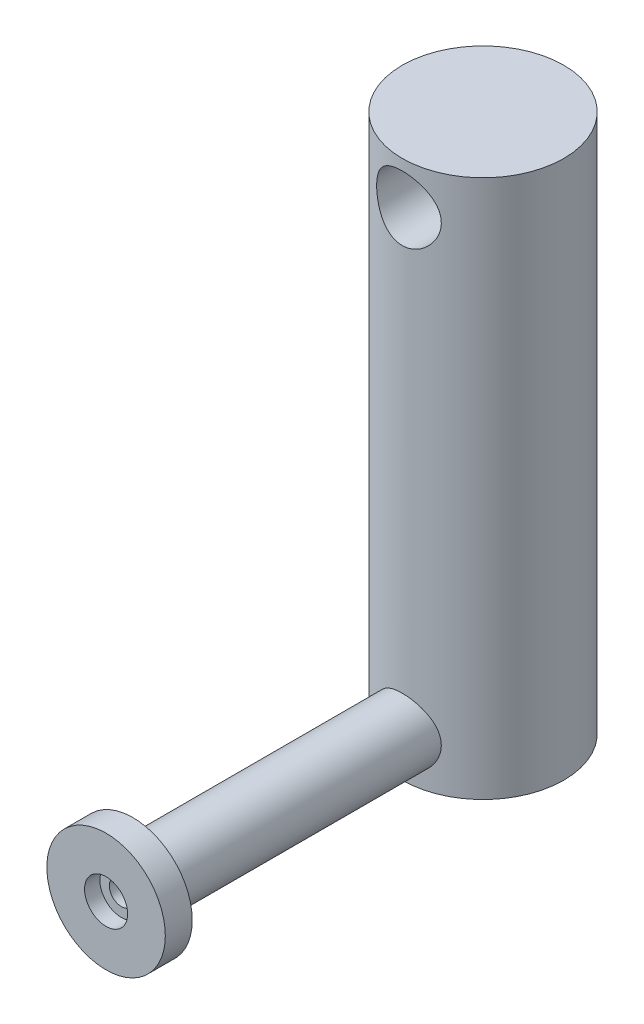
ISO-10303-21;
HEADER;
FILE_DESCRIPTION(('STEP AP214'),'2;1');
FILE_NAME('part.step','',(''),(''),'','','');
FILE_SCHEMA(('AUTOMOTIVE_DESIGN { 1 0 10303 214 1 1 1 1 }'));
ENDSEC;
DATA;
#1=APPLICATION_CONTEXT('core data for automotive mechanical design processes');
#2=APPLICATION_PROTOCOL_DEFINITION('international standard','automotive_design',2000,#1);
#3=PRODUCT_CONTEXT('',#1,'mechanical');
#4=PRODUCT('Part','Part','',(#3));
#5=PRODUCT_RELATED_PRODUCT_CATEGORY('part','',(#4));
#6=PRODUCT_DEFINITION_FORMATION('','',#4);
#7=PRODUCT_DEFINITION_CONTEXT('part definition',#1,'design');
#8=PRODUCT_DEFINITION('design','',#6,#7);
#9=PRODUCT_DEFINITION_SHAPE('','',#8);
#10=(LENGTH_UNIT() NAMED_UNIT(*) SI_UNIT(.MILLI.,.METRE.));
#11=(NAMED_UNIT(*) PLANE_ANGLE_UNIT() SI_UNIT($,.RADIAN.));
#12=(NAMED_UNIT(*) SI_UNIT($,.STERADIAN.) SOLID_ANGLE_UNIT());
#13=UNCERTAINTY_MEASURE_WITH_UNIT(LENGTH_MEASURE(1.E-05),#10,'distance_accuracy_value','');
#14=(GEOMETRIC_REPRESENTATION_CONTEXT(3) GLOBAL_UNCERTAINTY_ASSIGNED_CONTEXT((#13)) GLOBAL_UNIT_ASSIGNED_CONTEXT((#10,
#11,#12)) REPRESENTATION_CONTEXT('',''));
#15=CARTESIAN_POINT('',(0.,0.,0.));
#16=DIRECTION('',(0.,0.,1.));
#17=DIRECTION('',(1.,0.,0.));
#18=AXIS2_PLACEMENT_3D('',#15,#16,#17);
#19=CARTESIAN_POINT('',(0.,8.,65.));
#20=DIRECTION('',(0.,0.,-1.));
#21=DIRECTION('',(-1.,0.,0.));
#22=AXIS2_PLACEMENT_3D('',#19,#20,#21);
#23=CYLINDRICAL_SURFACE('',#22,6.);
#24=CARTESIAN_POINT('',(0.,8.,65.));
#25=DIRECTION('',(0.,0.,1.));
#26=DIRECTION('',(1.,0.,0.));
#27=AXIS2_PLACEMENT_3D('',#24,#25,#26);
#28=CIRCLE('',#27,6.);
#29=CARTESIAN_POINT('',(6.,8.,65.));
#30=VERTEX_POINT('',#29);
#31=EDGE_CURVE('E11',#30,#30,#28,.T.);
#32=ORIENTED_EDGE('',*,*,#31,.F.);
#33=EDGE_LOOP('',(#32));
#34=FACE_BOUND('',#33,.T.);
#35=CARTESIAN_POINT('',(6.,8.,13.7477270848675));
#36=CARTESIAN_POINT('',(5.99999875640954,8.16076598482738,13.7477283260629));
#37=CARTESIAN_POINT('',(5.99352975206176,8.32158110601548,13.7505565594333));
#38=CARTESIAN_POINT('',(5.96771672897827,8.64204882535129,13.7617785399654));
#39=CARTESIAN_POINT('',(5.94836482999676,8.80170065146873,13.7701756935283));
#40=CARTESIAN_POINT('',(5.89694174030869,9.11890142617686,13.7922754357519));
#41=CARTESIAN_POINT('',(5.86484520413903,9.27644553381237,13.8059885951419));
#42=CARTESIAN_POINT('',(5.78825391878448,9.58804060527395,13.8382744776157));
#43=CARTESIAN_POINT('',(5.74375401859824,9.74209008901072,13.8568492194736));
#44=CARTESIAN_POINT('',(5.64299599700453,10.0449832651282,13.8981849934125));
#45=CARTESIAN_POINT('',(5.58678827846126,10.1938461795796,13.9209280318917));
#46=CARTESIAN_POINT('',(5.46298123967255,10.4861745059142,13.969977180975));
#47=CARTESIAN_POINT('',(5.39537758446074,10.6296378383192,13.9962846467221));
#48=CARTESIAN_POINT('',(5.17633416323045,11.0504811630918,14.0794173286744));
#49=CARTESIAN_POINT('',(5.00853494267613,11.3186931077142,14.1405074748907));
#50=CARTESIAN_POINT('',(4.62391158998239,11.8378592545825,14.2710405221571));
#51=CARTESIAN_POINT('',(4.40499626343136,12.0871970513873,14.340752300891));
#52=CARTESIAN_POINT('',(4.0481020989243,12.4317390645763,14.4439708651047));
#53=CARTESIAN_POINT('',(3.9242905158216,12.5417399755175,14.4781748598032));
#54=CARTESIAN_POINT('',(3.66779743847793,12.7512789373329,14.5452673983772));
#55=CARTESIAN_POINT('',(3.53511902618019,12.850820593021,14.5781563930343));
#56=CARTESIAN_POINT('',(3.25615691069843,13.042541605752,14.6430448615306));
#57=CARTESIAN_POINT('',(3.10954147620186,13.1342681993675,14.6749563607157));
#58=CARTESIAN_POINT('',(2.80847871906791,13.3049385222444,14.7355355933009));
#59=CARTESIAN_POINT('',(2.65403441109174,13.3838871235516,14.7642045617649));
#60=CARTESIAN_POINT('',(2.33831705380735,13.5283274480482,14.8174861755334));
#61=CARTESIAN_POINT('',(2.1770447537532,13.5938206431435,14.8420992644581));
#62=CARTESIAN_POINT('',(1.8488303602226,13.710706307039,14.8865456688032));
#63=CARTESIAN_POINT('',(1.68188862975967,13.762099676745,14.9063792895972));
#64=CARTESIAN_POINT('',(1.35182764993867,13.8480957076311,14.9398371015626));
#65=CARTESIAN_POINT('',(1.18891435676812,13.8833905448022,14.9537153305611));
#66=CARTESIAN_POINT('',(0.860364736698411,13.940333707631,14.9762104160573));
#67=CARTESIAN_POINT('',(0.694728571347243,13.9619828399113,14.9848275835451));
#68=CARTESIAN_POINT('',(0.362083680846927,13.9913910715253,14.9965524359366));
#69=CARTESIAN_POINT('',(0.195075387211746,13.9991543815219,14.9996617909972));
#70=CARTESIAN_POINT('',(-0.139014166426379,14.0007146652515,15.0002858279534));
#71=CARTESIAN_POINT('',(-0.306095423657633,13.9945121299872,14.9978007065363));
#72=CARTESIAN_POINT('',(-0.629581360842826,13.9689571486784,14.9876056811723));
#73=CARTESIAN_POINT('',(-0.786056489987585,13.950366478925,14.9801985155737));
#74=CARTESIAN_POINT('',(-1.09682374164985,13.9009947102182,14.9606558816458));
#75=CARTESIAN_POINT('',(-1.25111513504043,13.8702096346988,14.9485188709466));
#76=CARTESIAN_POINT('',(-1.55636446880933,13.7967547638698,14.9198265516691));
#77=CARTESIAN_POINT('',(-1.70732347781249,13.7540888400518,14.9032726824411));
#78=CARTESIAN_POINT('',(-2.00504692560526,13.6572347463826,14.8661462906548));
#79=CARTESIAN_POINT('',(-2.15180974700395,13.6030421998243,14.8455722418593));
#80=CARTESIAN_POINT('',(-2.44232275401438,13.4827122452092,14.8005733913406));
#81=CARTESIAN_POINT('',(-2.58599723661979,13.4164113777625,14.7760965609745));
#82=CARTESIAN_POINT('',(-2.86725918170996,13.2729288476492,14.7241067343258));
#83=CARTESIAN_POINT('',(-3.00484439132129,13.1957432013856,14.696592627269));
#84=CARTESIAN_POINT('',(-3.40726603321778,12.948688374456,14.6104618941818));
#85=CARTESIAN_POINT('',(-3.66195901653258,12.7632418772394,14.5482260457696));
#86=CARTESIAN_POINT('',(-4.15437949370373,12.3419915764659,14.4156330049764));
#87=CARTESIAN_POINT('',(-4.38989525780836,12.1036809528053,14.3450108782861));
#88=CARTESIAN_POINT('',(-4.71121812404964,11.7191971043517,14.2413889925105));
#89=CARTESIAN_POINT('',(-4.81305918105095,11.5864329939912,14.2072110490304));
#90=CARTESIAN_POINT('',(-5.0054684951315,11.3125897118592,14.1405668936191));
#91=CARTESIAN_POINT('',(-5.09604089492643,11.171513624108,14.1081000551767));
#92=CARTESIAN_POINT('',(-5.2677144885335,10.8776679791937,14.0449207716186));
#93=CARTESIAN_POINT('',(-5.34846830074845,10.7246787891823,14.0142856556237));
#94=CARTESIAN_POINT('',(-5.49666677344656,10.4117640686962,13.9568252487564));
#95=CARTESIAN_POINT('',(-5.56411683616809,10.2518413860096,13.9299984127055));
#96=CARTESIAN_POINT('',(-5.68507549818268,9.92615715736025,13.8810726170423));
#97=CARTESIAN_POINT('',(-5.73858849912392,9.76039747367877,13.8589721651234));
#98=CARTESIAN_POINT('',(-5.83111405710326,9.42425050711976,13.8202977451039));
#99=CARTESIAN_POINT('',(-5.87012778144672,9.2538635979558,13.803723332125));
#100=CARTESIAN_POINT('',(-5.93126188446899,8.92037550293277,13.7775602957139));
#101=CARTESIAN_POINT('',(-5.95426866502425,8.75746509869363,13.7676067715781));
#102=CARTESIAN_POINT('',(-5.98682783069773,8.43005941910831,13.7534799529363));
#103=CARTESIAN_POINT('',(-5.99638101339171,8.26556423829532,13.7493063157788));
#104=CARTESIAN_POINT('',(-6.00192022727181,7.93634499724553,13.7468891908443));
#105=CARTESIAN_POINT('',(-5.99790972463035,7.77162100623468,13.7486441880165));
#106=CARTESIAN_POINT('',(-5.97637695694085,7.44323030234847,13.7580178863429));
#107=CARTESIAN_POINT('',(-5.95885503253298,7.27956356292335,13.7656364396694));
#108=CARTESIAN_POINT('',(-5.91189113707813,6.96388493285904,13.7858678469555));
#109=CARTESIAN_POINT('',(-5.88318889041452,6.81174216524755,13.7981698606254));
#110=CARTESIAN_POINT('',(-5.81422990546568,6.51049878730527,13.8273689308218));
#111=CARTESIAN_POINT('',(-5.77396942701893,6.3613991784739,13.8442674746596));
#112=CARTESIAN_POINT('',(-5.68227161206331,6.06725076083849,13.8821556875076));
#113=CARTESIAN_POINT('',(-5.63083646021821,5.92220116649752,13.9031445567712));
#114=CARTESIAN_POINT('',(-5.51718647350251,5.63689974950036,13.9486342853423));
#115=CARTESIAN_POINT('',(-5.45496750289055,5.49664979237216,13.9731364914375));
#116=CARTESIAN_POINT('',(-5.31751145640008,5.21622103433918,14.0260368054118));
#117=CARTESIAN_POINT('',(-5.24185178482307,5.07627148339986,14.054551887834));
#118=CARTESIAN_POINT('',(-5.07988717682862,4.80313174732677,14.1139004091642));
#119=CARTESIAN_POINT('',(-4.99357859530799,4.66994389885387,14.144734640495));
#120=CARTESIAN_POINT('',(-4.81086355761932,4.41103058661941,14.2079180408565));
#121=CARTESIAN_POINT('',(-4.71445526541627,4.28530648622994,14.2402674847459));
#122=CARTESIAN_POINT('',(-4.51210358125893,4.04197483985671,14.3056711379351));
#123=CARTESIAN_POINT('',(-4.40615981558121,3.92436761231666,14.338725374819));
#124=CARTESIAN_POINT('',(-4.17710486838273,3.68947089789745,14.4071898083664));
#125=CARTESIAN_POINT('',(-4.05330323673504,3.57285146369597,14.442592979753));
#126=CARTESIAN_POINT('',(-3.79611595891185,3.35044107746035,14.5123136561683));
#127=CARTESIAN_POINT('',(-3.66273336488668,3.24464670276108,14.5466315019691));
#128=CARTESIAN_POINT('',(-3.38706145939603,3.04451435610422,14.6132792135403));
#129=CARTESIAN_POINT('',(-3.24476806677012,2.95018169264924,14.6456081547515));
#130=CARTESIAN_POINT('',(-2.95225256674959,2.77378136334621,14.7073633349577));
#131=CARTESIAN_POINT('',(-2.80203390506011,2.69170842578633,14.7367908197248));
#132=CARTESIAN_POINT('',(-2.49453307495679,2.54045157600446,14.7919473555791));
#133=CARTESIAN_POINT('',(-2.3372490996887,2.47127098437562,14.8176754534518));
#134=CARTESIAN_POINT('',(-2.01680521759424,2.34650155372972,14.8646797598965));
#135=CARTESIAN_POINT('',(-1.85364780662784,2.29090701787589,14.8859578338886));
#136=CARTESIAN_POINT('',(-1.52264805192432,2.19385845199867,14.9234471639802));
#137=CARTESIAN_POINT('',(-1.35480680859647,2.15240113036746,14.9396595994531));
#138=CARTESIAN_POINT('',(-1.01574606559106,2.08407562736267,14.9665350610502));
#139=CARTESIAN_POINT('',(-0.844526795116486,2.05720645967028,14.9771984623478));
#140=CARTESIAN_POINT('',(-0.511396994408886,2.01963967541453,14.9921458117432));
#141=CARTESIAN_POINT('',(-0.349608608417646,2.00800071584866,14.9968008342727));
#142=CARTESIAN_POINT('',(-0.0255568035504899,1.99786526314398,15.0008532559057));
#143=CARTESIAN_POINT('',(0.13670659774313,1.99936828956347,15.0002508472092));
#144=CARTESIAN_POINT('',(0.46044915787151,2.01549904517884,14.9938053140504));
#145=CARTESIAN_POINT('',(0.621928426150299,2.03012488656084,14.9879629433954));
#146=CARTESIAN_POINT('',(0.942913616351044,2.07234304237388,14.9711970812456));
#147=CARTESIAN_POINT('',(1.10241954563225,2.09993530843377,14.9602736087057));
#148=CARTESIAN_POINT('',(1.41340092731344,2.16675006249559,14.9340514560138));
#149=CARTESIAN_POINT('',(1.56497209153591,2.20558587323356,14.9188987624389));
#150=CARTESIAN_POINT('',(1.8642394853253,2.29482683138478,14.8844652752771));
#151=CARTESIAN_POINT('',(2.01193442094207,2.34523578871987,14.8651831223981));
#152=CARTESIAN_POINT('',(2.302462712288,2.45717619515102,14.8229622791787));
#153=CARTESIAN_POINT('',(2.44529715629449,2.51870513472081,14.8000244139869));
#154=CARTESIAN_POINT('',(2.72537941223682,2.65243971671062,14.7510179336099));
#155=CARTESIAN_POINT('',(2.86262507421093,2.72464941936831,14.7249481285447));
#156=CARTESIAN_POINT('',(3.13662388518831,2.88260994638361,14.6690826919464));
#157=CARTESIAN_POINT('',(3.27309180108705,2.96881555131694,14.6391738407242));
#158=CARTESIAN_POINT('',(3.53838180351729,3.15171951689201,14.5773253906917));
#159=CARTESIAN_POINT('',(3.66720122604104,3.24842150069046,14.5453850922484));
#160=CARTESIAN_POINT('',(3.91649343612946,3.45170886191089,14.480251425724));
#161=CARTESIAN_POINT('',(4.03696455988818,3.55829619963078,14.447057809883));
#162=CARTESIAN_POINT('',(4.26890539529755,3.78072670262354,14.3802300314779));
#163=CARTESIAN_POINT('',(4.38037483126384,3.89657015115671,14.3465958554578));
#164=CARTESIAN_POINT('',(4.6003520349242,4.14436931770692,14.2776350231095));
#165=CARTESIAN_POINT('',(4.7082445488358,4.27687901691599,14.2423331872708));
#166=CARTESIAN_POINT('',(4.91246454048886,4.55081614977952,14.1731899755842));
#167=CARTESIAN_POINT('',(5.0087959135827,4.69224055512316,14.1393481102969));
#168=CARTESIAN_POINT('',(5.18930521843519,4.98330426589871,14.0741014017048));
#169=CARTESIAN_POINT('',(5.27347593316246,5.13294837739946,14.0426980106418));
#170=CARTESIAN_POINT('',(5.42888140715686,5.43938662075409,13.9833532160291));
#171=CARTESIAN_POINT('',(5.50012246229139,5.59617722596415,13.9554101296628));
#172=CARTESIAN_POINT('',(5.62329338728312,5.90161698772481,13.9062060888812));
#173=CARTESIAN_POINT('',(5.67638059374281,6.0497399517391,13.8845710059473));
#174=CARTESIAN_POINT('',(5.77085722264898,6.3501563851321,13.8455704717994));
#175=CARTESIAN_POINT('',(5.81225194839873,6.50244792929539,13.8282030853728));
#176=CARTESIAN_POINT('',(5.88290316620707,6.80992357107783,13.7982941020335));
#177=CARTESIAN_POINT('',(5.91218652902551,6.9651004584769,13.7857418266595));
#178=CARTESIAN_POINT('',(5.95843701087143,7.27754448449443,13.7658152395796));
#179=CARTESIAN_POINT('',(5.97541127868373,7.43481035575321,13.7584379224814));
#180=CARTESIAN_POINT('',(5.99076318011059,7.66032523302881,13.751755327731));
#181=CARTESIAN_POINT('',(5.99422579943118,7.72819955445766,13.7502459479373));
#182=CARTESIAN_POINT('',(5.99884455686221,7.86404631736154,13.7482315272618));
#183=CARTESIAN_POINT('',(6.00000052586257,7.9320187656651,13.7477265600177));
#184=CARTESIAN_POINT('',(6.,8.,13.7477270848675));
#185=B_SPLINE_CURVE_WITH_KNOTS('',3,(#35,#36,#37,#38,#39,#40,#41,#42,#43,#44,#45,#46,#47,#48,
#49,#50,#51,#52,#53,#54,#55,#56,#57,#58,#59,#60,#61,#62,#63,#64,#65,#66,#67,#68,#69,#70,#71,#72,
#73,#74,#75,#76,#77,#78,#79,#80,#81,#82,#83,#84,#85,#86,#87,#88,#89,#90,#91,#92,#93,#94,#95,#96,
#97,#98,#99,#100,#101,#102,#103,#104,#105,#106,#107,#108,#109,#110,#111,#112,#113,#114,#115,
#116,#117,#118,#119,#120,#121,#122,#123,#124,#125,#126,#127,#128,#129,#130,#131,#132,#133,#134,
#135,#136,#137,#138,#139,#140,#141,#142,#143,#144,#145,#146,#147,#148,#149,#150,#151,#152,#153,
#154,#155,#156,#157,#158,#159,#160,#161,#162,#163,#164,#165,#166,#167,#168,#169,#170,#171,#172,
#173,#174,#175,#176,#177,#178,#179,#180,#181,#182,#183,#184),.UNSPECIFIED.,.T.,.F.,(4,2,2,2,2,2,
2,2,2,2,2,2,2,2,2,2,2,2,2,2,2,2,2,2,2,2,2,2,2,2,2,2,2,2,2,2,2,2,2,2,2,2,2,2,2,2,2,2,2,2,2,2,2,2,
2,2,2,2,2,2,2,2,2,2,2,2,2,2,2,2,2,2,2,2,4),(0.,0.482229125007608,0.964753492666788,
1.44824230932755,1.93193221431692,2.41358131868909,2.89541405552194,3.85788445035762,
4.87027013417452,5.37714851669966,5.88385162504574,6.41078994114098,6.93752686828076,
7.4642061442031,7.99085176020979,8.4920122856123,8.99314318371741,9.49412209577398,
9.99508339499092,10.4677763229104,10.9406235219094,11.4133168189293,11.8861899210207,
12.3659950936627,12.8459763227003,13.8053197638543,14.827648638094,15.3395121452938,
15.8511869156833,16.3775800271824,16.9037589447639,17.429771480738,17.9557416594036,
18.4495809207953,18.9433909044569,19.4370747055101,19.9307460605728,20.3961592499499,
20.8617232138062,21.3271962410503,21.7928481801528,22.2772086524077,22.7617353827804,
23.2463503490362,23.7309843170643,24.2515501140932,24.7719508068031,25.2925916122044,
25.8130078923152,26.3335580277819,26.8538895128004,27.3740997647064,27.8942748403263,
28.3804860466243,28.8666794781986,29.3528029784681,29.8389246652723,30.309990273523,
30.7812111812125,31.2523258775871,31.7236201282936,32.2155707501999,32.7076917276986,
33.1999105039097,33.6921443490278,34.2149887213889,34.7376564316676,35.2606330684224,
35.7833543637692,36.2593204433439,36.7350702933027,37.2097588887462,37.684171576794,
37.8880712265046,38.0919858243933),.UNSPECIFIED.);
#186=CARTESIAN_POINT('',(6.,8.,13.7477270848675));
#187=VERTEX_POINT('',#186);
#188=EDGE_CURVE('E51',#187,#187,#185,.T.);
#189=ORIENTED_EDGE('',*,*,#188,.T.);
#190=EDGE_LOOP('',(#189));
#191=FACE_BOUND('',#190,.T.);
#192=ADVANCED_FACE('F45',(#34,#191),#23,.T.);
#193=CARTESIAN_POINT('',(0.,100.,0.));
#194=DIRECTION('',(0.,-1.,0.));
#195=DIRECTION('',(0.,0.,-1.));
#196=AXIS2_PLACEMENT_3D('',#193,#194,#195);
#197=CYLINDRICAL_SURFACE('',#196,15.);
#198=ORIENTED_EDGE('',*,*,#188,.F.);
#199=EDGE_LOOP('',(#198));
#200=FACE_BOUND('',#199,.T.);
#201=ADVANCED_FACE('F67',(#200),#197,.F.);
#202=CARTESIAN_POINT('',(0.,8.,70.));
#203=DIRECTION('',(0.,0.,-1.));
#204=DIRECTION('',(-1.,0.,0.));
#205=AXIS2_PLACEMENT_3D('',#202,#203,#204);
#206=CYLINDRICAL_SURFACE('',#205,11.);
#207=CARTESIAN_POINT('',(0.,8.,70.));
#208=DIRECTION('',(0.,0.,1.));
#209=DIRECTION('',(1.,0.,0.));
#210=AXIS2_PLACEMENT_3D('',#207,#208,#209);
#211=CIRCLE('',#210,11.);
#212=CARTESIAN_POINT('',(11.,8.,70.));
#213=VERTEX_POINT('',#212);
#214=EDGE_CURVE('E55',#213,#213,#211,.T.);
#215=ORIENTED_EDGE('',*,*,#214,.F.);
#216=EDGE_LOOP('',(#215));
#217=FACE_BOUND('',#216,.T.);
#218=CARTESIAN_POINT('',(0.,8.,65.));
#219=DIRECTION('',(0.,0.,1.));
#220=DIRECTION('',(1.,0.,0.));
#221=AXIS2_PLACEMENT_3D('',#218,#219,#220);
#222=CIRCLE('',#221,11.);
#223=CARTESIAN_POINT('',(11.,8.,65.));
#224=VERTEX_POINT('',#223);
#225=EDGE_CURVE('E59',#224,#224,#222,.T.);
#226=ORIENTED_EDGE('',*,*,#225,.T.);
#227=EDGE_LOOP('',(#226));
#228=FACE_BOUND('',#227,.T.);
#229=ADVANCED_FACE('F71',(#217,#228),#206,.T.);
#230=CARTESIAN_POINT('',(0.,8.,70.));
#231=DIRECTION('',(0.,0.,1.));
#232=DIRECTION('',(1.,0.,0.));
#233=AXIS2_PLACEMENT_3D('',#230,#231,#232);
#234=PLANE('',#233);
#235=CARTESIAN_POINT('',(0.,8.,70.));
#236=DIRECTION('',(0.,0.,1.));
#237=DIRECTION('',(1.,0.,0.));
#238=AXIS2_PLACEMENT_3D('',#235,#236,#237);
#239=CIRCLE('',#238,4.);
#240=CARTESIAN_POINT('',(4.,8.,70.));
#241=VERTEX_POINT('',#240);
#242=EDGE_CURVE('E160',#241,#241,#239,.T.);
#243=ORIENTED_EDGE('',*,*,#242,.F.);
#244=EDGE_LOOP('',(#243));
#245=FACE_BOUND('',#244,.T.);
#246=ORIENTED_EDGE('',*,*,#214,.T.);
#247=EDGE_LOOP('',(#246));
#248=FACE_BOUND('',#247,.T.);
#249=ADVANCED_FACE('F75',(#245,#248),#234,.T.);
#250=CARTESIAN_POINT('',(0.,8.,65.));
#251=DIRECTION('',(0.,0.,1.));
#252=DIRECTION('',(1.,0.,0.));
#253=AXIS2_PLACEMENT_3D('',#250,#251,#252);
#254=PLANE('',#253);
#255=ORIENTED_EDGE('',*,*,#31,.T.);
#256=EDGE_LOOP('',(#255));
#257=FACE_BOUND('',#256,.T.);
#258=ORIENTED_EDGE('',*,*,#225,.F.);
#259=EDGE_LOOP('',(#258));
#260=FACE_BOUND('',#259,.T.);
#261=ADVANCED_FACE('F77',(#257,#260),#254,.F.);
#262=CARTESIAN_POINT('',(0.,8.,67.15));
#263=DIRECTION('',(0.,0.,1.));
#264=DIRECTION('',(1.,0.,0.));
#265=AXIS2_PLACEMENT_3D('',#262,#263,#264);
#266=CYLINDRICAL_SURFACE('',#265,4.);
#267=CARTESIAN_POINT('',(0.,8.,67.15));
#268=DIRECTION('',(0.,0.,1.));
#269=DIRECTION('',(1.,0.,0.));
#270=AXIS2_PLACEMENT_3D('',#267,#268,#269);
#271=CIRCLE('',#270,4.);
#272=CARTESIAN_POINT('',(4.,8.,67.15));
#273=VERTEX_POINT('',#272);
#274=EDGE_CURVE('E164',#273,#273,#271,.T.);
#275=ORIENTED_EDGE('',*,*,#274,.F.);
#276=EDGE_LOOP('',(#275));
#277=FACE_BOUND('',#276,.T.);
#278=ORIENTED_EDGE('',*,*,#242,.T.);
#279=EDGE_LOOP('',(#278));
#280=FACE_BOUND('',#279,.T.);
#281=ADVANCED_FACE('F80',(#277,#280),#266,.F.);
#282=CARTESIAN_POINT('',(0.,8.,67.15));
#283=DIRECTION('',(0.,0.,1.));
#284=DIRECTION('',(1.,0.,0.));
#285=AXIS2_PLACEMENT_3D('',#282,#283,#284);
#286=PLANE('',#285);
#287=CARTESIAN_POINT('',(0.,8.,67.15));
#288=DIRECTION('',(0.,0.,1.));
#289=DIRECTION('',(1.,0.,0.));
#290=AXIS2_PLACEMENT_3D('',#287,#288,#289);
#291=CIRCLE('',#290,2.25);
#292=CARTESIAN_POINT('',(2.25,8.,67.15));
#293=VERTEX_POINT('',#292);
#294=EDGE_CURVE('E161',#293,#293,#291,.T.);
#295=ORIENTED_EDGE('',*,*,#294,.F.);
#296=EDGE_LOOP('',(#295));
#297=FACE_BOUND('',#296,.T.);
#298=ORIENTED_EDGE('',*,*,#274,.T.);
#299=EDGE_LOOP('',(#298));
#300=FACE_BOUND('',#299,.T.);
#301=ADVANCED_FACE('F86',(#297,#300),#286,.T.);
#302=CARTESIAN_POINT('',(0.,8.,64.65));
#303=DIRECTION('',(0.,0.,1.));
#304=DIRECTION('',(1.,0.,0.));
#305=AXIS2_PLACEMENT_3D('',#302,#303,#304);
#306=CYLINDRICAL_SURFACE('',#305,2.25);
#307=CARTESIAN_POINT('',(0.,8.,64.65));
#308=DIRECTION('',(0.,0.,1.));
#309=DIRECTION('',(1.,0.,0.));
#310=AXIS2_PLACEMENT_3D('',#307,#308,#309);
#311=CIRCLE('',#310,2.25);
#312=CARTESIAN_POINT('',(2.25,8.,64.65));
#313=VERTEX_POINT('',#312);
#314=EDGE_CURVE('E159',#313,#313,#311,.T.);
#315=ORIENTED_EDGE('',*,*,#314,.F.);
#316=EDGE_LOOP('',(#315));
#317=FACE_BOUND('',#316,.T.);
#318=ORIENTED_EDGE('',*,*,#294,.T.);
#319=EDGE_LOOP('',(#318));
#320=FACE_BOUND('',#319,.T.);
#321=ADVANCED_FACE('F90',(#317,#320),#306,.F.);
#322=CARTESIAN_POINT('',(0.,8.,64.65));
#323=DIRECTION('',(0.,0.,1.));
#324=DIRECTION('',(1.,0.,0.));
#325=AXIS2_PLACEMENT_3D('',#322,#323,#324);
#326=PLANE('',#325);
#327=ORIENTED_EDGE('',*,*,#314,.T.);
#328=EDGE_LOOP('',(#327));
#329=FACE_BOUND('',#328,.T.);
#330=ADVANCED_FACE('F94',(#329),#326,.T.);
#331=CLOSED_SHELL('',(#192,#201,#229,#249,#261,#281,#301,#321,#330));
#332=MANIFOLD_SOLID_BREP('B2',#331);
#333=CARTESIAN_POINT('',(0.,100.,0.));
#334=DIRECTION('',(0.,-1.,0.));
#335=DIRECTION('',(0.,0.,-1.));
#336=AXIS2_PLACEMENT_3D('',#333,#334,#335);
#337=CYLINDRICAL_SURFACE('',#336,15.);
#338=CARTESIAN_POINT('',(0.,100.,0.));
#339=DIRECTION('',(0.,1.,0.));
#340=DIRECTION('',(0.,0.,1.));
#341=AXIS2_PLACEMENT_3D('',#338,#339,#340);
#342=CIRCLE('',#341,15.);
#343=CARTESIAN_POINT('',(0.,100.,15.));
#344=VERTEX_POINT('',#343);
#345=EDGE_CURVE('E196',#344,#344,#342,.T.);
#346=ORIENTED_EDGE('',*,*,#345,.F.);
#347=EDGE_LOOP('',(#346));
#348=FACE_BOUND('',#347,.T.);
#349=CARTESIAN_POINT('',(0.,0.,0.));
#350=DIRECTION('',(0.,1.,0.));
#351=DIRECTION('',(0.,0.,1.));
#352=AXIS2_PLACEMENT_3D('',#349,#350,#351);
#353=CIRCLE('',#352,15.);
#354=CARTESIAN_POINT('',(0.,0.,15.));
#355=VERTEX_POINT('',#354);
#356=EDGE_CURVE('E200',#355,#355,#353,.T.);
#357=ORIENTED_EDGE('',*,*,#356,.T.);
#358=EDGE_LOOP('',(#357));
#359=FACE_BOUND('',#358,.T.);
#360=CARTESIAN_POINT('',(0.,98.,-15.));
#361=CARTESIAN_POINT('',(0.161313644504795,97.9999990763371,-14.9999992799423));
#362=CARTESIAN_POINT('',(0.322689516963507,97.9934855013958,-14.9973905442872));
#363=CARTESIAN_POINT('',(0.64429962319549,97.9674898782125,-14.9870209396163));
#364=CARTESIAN_POINT('',(0.80453302218813,97.9479991684452,-14.9792566295469));
#365=CARTESIAN_POINT('',(1.12295032515216,97.8961896196803,-14.9587594719095));
#366=CARTESIAN_POINT('',(1.28112908028619,97.863843282184,-14.9460159747332));
#367=CARTESIAN_POINT('',(1.5940111010847,97.7866317701457,-14.9158923525357));
#368=CARTESIAN_POINT('',(1.74871291854088,97.741761479865,-14.8985103329152));
#369=CARTESIAN_POINT('',(2.05297112205075,97.6401188046392,-14.85963474988));
#370=CARTESIAN_POINT('',(2.20254446893524,97.5833911959363,-14.8381566801894));
#371=CARTESIAN_POINT('',(2.49626491179011,97.4584017024408,-14.7915782226374));
#372=CARTESIAN_POINT('',(2.64040995626987,97.3901355093753,-14.7664764822838));
#373=CARTESIAN_POINT('',(2.92227692731373,97.2426681971428,-14.7132880124765));
#374=CARTESIAN_POINT('',(3.06000372368526,97.1634755552049,-14.6852036009652));
#375=CARTESIAN_POINT('',(3.32842124549353,96.9946751836688,-14.6267056927006));
#376=CARTESIAN_POINT('',(3.45910939916273,96.9050636845176,-14.5962913543435));
#377=CARTESIAN_POINT('',(3.8503463050522,96.6134009680257,-14.4999578839521));
#378=CARTESIAN_POINT('',(4.09812078052022,96.3947515037883,-14.4312855983673));
#379=CARTESIAN_POINT('',(4.55459108369287,95.9197284822013,-14.2938006085538));
#380=CARTESIAN_POINT('',(4.76326779263535,95.6633365776994,-14.2249878521747));
#381=CARTESIAN_POINT('',(5.04723766459798,95.2488756985875,-14.1257237119283));
#382=CARTESIAN_POINT('',(5.13866506559553,95.1022648970436,-14.0926348838902));
#383=CARTESIAN_POINT('',(5.30875946518038,94.8012358186711,-14.0294439987206));
#384=CARTESIAN_POINT('',(5.38743171147838,94.6468207871239,-13.9993407152693));
#385=CARTESIAN_POINT('',(5.53135072514938,94.3311496933485,-13.9431035259271));
#386=CARTESIAN_POINT('',(5.59659658448499,94.1698931693136,-13.9169698885377));
#387=CARTESIAN_POINT('',(5.71298893930062,93.8417492993048,-13.8695965651366));
#388=CARTESIAN_POINT('',(5.76414249748569,93.6748648211636,-13.8483544285077));
#389=CARTESIAN_POINT('',(5.84985002952935,93.3442805788518,-13.812361071961));
#390=CARTESIAN_POINT('',(5.88504634552834,93.1807744062204,-13.7973611781672));
#391=CARTESIAN_POINT('',(5.94169028877153,92.8510475821048,-13.7730632035884));
#392=CARTESIAN_POINT('',(5.96314412514811,92.6848281913697,-13.763762547854));
#393=CARTESIAN_POINT('',(5.99206783200916,92.3509840794924,-13.7511953307051));
#394=CARTESIAN_POINT('',(5.99954065663821,92.1833596627484,-13.7479274945764));
#395=CARTESIAN_POINT('',(6.00041818162586,91.8480709001244,-13.7475446397));
#396=CARTESIAN_POINT('',(5.99382353813072,91.6804065564714,-13.7504293339811));
#397=CARTESIAN_POINT('',(5.96760177471961,91.3581150722591,-13.7618280557533));
#398=CARTESIAN_POINT('',(5.94891756277296,91.2033956295018,-13.7699346208222));
#399=CARTESIAN_POINT('',(5.8996396544996,90.896159193445,-13.7911192754836));
#400=CARTESIAN_POINT('',(5.86904203850858,90.7436429421696,-13.8041990012772));
#401=CARTESIAN_POINT('',(5.79624600676145,90.4419202009817,-13.8349228158605));
#402=CARTESIAN_POINT('',(5.75405038400525,90.2927129235482,-13.8525658056772));
#403=CARTESIAN_POINT('',(5.65841794933909,89.9984373160379,-13.8919033105674));
#404=CARTESIAN_POINT('',(5.60497681726874,89.8533706010244,-13.9135993823432));
#405=CARTESIAN_POINT('',(5.48612076549079,89.5654107880334,-13.9608971317125));
#406=CARTESIAN_POINT('',(5.42048769239742,89.4226192329473,-13.9865682596972));
#407=CARTESIAN_POINT('',(5.27846344073438,89.1430045696326,-14.0407834641431));
#408=CARTESIAN_POINT('',(5.20206861926845,89.0061835030654,-14.0693285125008));
#409=CARTESIAN_POINT('',(5.03904071569065,88.7392438024992,-14.1285380661927));
#410=CARTESIAN_POINT('',(4.95240626250742,88.6091260694235,-14.1592028551284));
#411=CARTESIAN_POINT('',(4.76942720642661,88.3562485672333,-14.2218815851021));
#412=CARTESIAN_POINT('',(4.67308210238212,88.2334891783898,-14.2538955957211));
#413=CARTESIAN_POINT('',(4.46337699329053,87.9867125608195,-14.321009166178));
#414=CARTESIAN_POINT('',(4.34927691149484,87.8633359835571,-14.3561554862976));
#415=CARTESIAN_POINT('',(4.11112913327325,87.6265800239504,-14.4261573040414));
#416=CARTESIAN_POINT('',(3.98708438059707,87.51319770389,-14.46101288438));
#417=CARTESIAN_POINT('',(3.72964838124062,87.2970234364176,-14.5295379121774));
#418=CARTESIAN_POINT('',(3.59625179230496,87.1942376264797,-14.563206664882));
#419=CARTESIAN_POINT('',(3.32099627612081,87.0000661124244,-14.6284304794354));
#420=CARTESIAN_POINT('',(3.17914076240928,86.9086758551241,-14.6599863831411));
#421=CARTESIAN_POINT('',(2.8848036324426,86.7362002936664,-14.7207656025778));
#422=CARTESIAN_POINT('',(2.73216491576376,86.6553614031936,-14.7499286757954));
#423=CARTESIAN_POINT('',(2.41997061448608,86.5069497525717,-14.8043518853361));
#424=CARTESIAN_POINT('',(2.26041784404164,86.4393716558007,-14.8296135908351));
#425=CARTESIAN_POINT('',(1.93550182558385,86.318108247081,-14.875508159045));
#426=CARTESIAN_POINT('',(1.77013973685015,86.2644201809906,-14.8961419392815));
#427=CARTESIAN_POINT('',(1.43484781894989,86.1714951268274,-14.9321676804159));
#428=CARTESIAN_POINT('',(1.26491830691482,86.1322571382043,-14.9475600042365));
#429=CARTESIAN_POINT('',(0.932043665210943,86.0705625046863,-14.9718895403));
#430=CARTESIAN_POINT('',(0.769280790194166,86.0472497453174,-14.9811550169986));
#431=CARTESIAN_POINT('',(0.442179347982646,86.0140583525531,-14.9943744084218));
#432=CARTESIAN_POINT('',(0.277840858808293,86.0041790573915,-14.9983285847944));
#433=CARTESIAN_POINT('',(-0.0510959013325356,85.9979633536429,-15.000814515054));
#434=CARTESIAN_POINT('',(-0.215694106984593,86.0016239576039,-14.9993474650838));
#435=CARTESIAN_POINT('',(-0.54389562011594,86.0224408619377,-14.9910347173186));
#436=CARTESIAN_POINT('',(-0.707498946609735,86.0395969035585,-14.9841891226479));
#437=CARTESIAN_POINT('',(-1.02510006060182,86.0861386822578,-14.9657383242369));
#438=CARTESIAN_POINT('',(-1.17919782151467,86.1149367227416,-14.9543621875242));
#439=CARTESIAN_POINT('',(-1.48434586639605,86.1843994061311,-14.9271627907189));
#440=CARTESIAN_POINT('',(-1.63539513588515,86.2250679318946,-14.9113380755507));
#441=CARTESIAN_POINT('',(-1.93337901855315,86.3178883378395,-14.8756364442751));
#442=CARTESIAN_POINT('',(-2.08031476115196,86.3700370304434,-14.8557606531008));
#443=CARTESIAN_POINT('',(-2.36928412673676,86.4854096029213,-14.8124221315374));
#444=CARTESIAN_POINT('',(-2.51131586022716,86.5486376958812,-14.788958037083));
#445=CARTESIAN_POINT('',(-2.79382655828656,86.6877436802185,-14.738240986786));
#446=CARTESIAN_POINT('',(-2.93412902369548,86.7639459872758,-14.7108949918607));
#447=CARTESIAN_POINT('',(-3.20788342050321,86.9270442086834,-14.653636047145));
#448=CARTESIAN_POINT('',(-3.34133298209497,87.0139437874406,-14.6237222187979));
#449=CARTESIAN_POINT('',(-3.60064969677007,87.1978553315034,-14.5620427444401));
#450=CARTESIAN_POINT('',(-3.72651556540459,87.2948690022766,-14.5302767865174));
#451=CARTESIAN_POINT('',(-3.97000140926484,87.4984146200534,-14.4656475212144));
#452=CARTESIAN_POINT('',(-4.08762102489383,87.6049469816811,-14.4327841660717));
#453=CARTESIAN_POINT('',(-4.32151965753385,87.8343017011696,-14.3645492876992));
#454=CARTESIAN_POINT('',(-4.43719333742261,87.9577357303629,-14.3291558684875));
#455=CARTESIAN_POINT('',(-4.65775251008148,88.2139847630681,-14.2589878283471));
#456=CARTESIAN_POINT('',(-4.76264135223886,88.346796832349,-14.2242130180919));
#457=CARTESIAN_POINT('',(-4.9610580489563,88.6211572374989,-14.1562321861325));
#458=CARTESIAN_POINT('',(-5.05457937701835,88.7627105223442,-14.1230270722696));
#459=CARTESIAN_POINT('',(-5.22948651451797,89.0536021679197,-14.0592011706988));
#460=CARTESIAN_POINT('',(-5.31087742412303,89.2029372210024,-14.0285792992444));
#461=CARTESIAN_POINT('',(-5.46168285847214,89.5101026008407,-13.9705625756139));
#462=CARTESIAN_POINT('',(-5.53096653567014,89.6680041306304,-13.9432038872192));
#463=CARTESIAN_POINT('',(-5.65585321672464,89.9897540710099,-13.8930146747533));
#464=CARTESIAN_POINT('',(-5.71146207536686,90.1535999019847,-13.8701822136217));
#465=CARTESIAN_POINT('',(-5.80843082990244,90.486032936934,-13.8298551049057));
#466=CARTESIAN_POINT('',(-5.84979637281906,90.65461823312,-13.8123583422014));
#467=CARTESIAN_POINT('',(-5.91782050130812,90.9952343023737,-13.7833513444251));
#468=CARTESIAN_POINT('',(-5.94448031809037,91.1672647857494,-13.7718406081887));
#469=CARTESIAN_POINT('',(-5.98138158194365,91.5008289388823,-13.755851283804));
#470=CARTESIAN_POINT('',(-5.99266704417584,91.6622264630661,-13.7509260111925));
#471=CARTESIAN_POINT('',(-6.00216046200423,91.9854766489458,-13.7467850410815));
#472=CARTESIAN_POINT('',(-6.00036897454033,92.1473292909651,-13.7475691004247));
#473=CARTESIAN_POINT('',(-5.98373064604635,92.4702112209036,-13.7548190919533));
#474=CARTESIAN_POINT('',(-5.96888538854158,92.6312406063073,-13.7612843349661));
#475=CARTESIAN_POINT('',(-5.9263097432402,92.9512677749796,-13.7796730336625));
#476=CARTESIAN_POINT('',(-5.89857941471414,93.1102655675898,-13.7915964642388));
#477=CARTESIAN_POINT('',(-5.83188915830647,93.4187951135104,-13.8199248571637));
#478=CARTESIAN_POINT('',(-5.79342041323657,93.5684516805446,-13.8361324385079));
#479=CARTESIAN_POINT('',(-5.70522097391949,93.863930328238,-13.872733403532));
#480=CARTESIAN_POINT('',(-5.65548660991751,94.0097511420932,-13.8931281509704));
#481=CARTESIAN_POINT('',(-5.54517998972387,94.296647321415,-13.9375216393973));
#482=CARTESIAN_POINT('',(-5.48460916869471,94.4377233123424,-13.9615199030744));
#483=CARTESIAN_POINT('',(-5.35307990924357,94.7144117275927,-14.0124768698205));
#484=CARTESIAN_POINT('',(-5.28211769758923,94.8500221443966,-14.0394366473567));
#485=CARTESIAN_POINT('',(-5.04570156991897,95.2626644137898,-14.1269314560258));
#486=CARTESIAN_POINT('',(-4.86295379872225,95.5291851425362,-14.1914514609348));
#487=CARTESIAN_POINT('',(-4.4576185471272,96.0290508408563,-14.3239291441595));
#488=CARTESIAN_POINT('',(-4.2350190587282,96.2623857728528,-14.3918878541759));
#489=CARTESIAN_POINT('',(-3.86726006921135,96.5906111142667,-14.4935144880377));
#490=CARTESIAN_POINT('',(-3.73448315683693,96.6992669907362,-14.5283750359907));
#491=CARTESIAN_POINT('',(-3.45982226643503,96.9050013050422,-14.596218858185));
#492=CARTESIAN_POINT('',(-3.31794165644067,97.0020839869775,-14.6292028182708));
#493=CARTESIAN_POINT('',(-3.02578567613311,97.1840400830178,-14.692412478083));
#494=CARTESIAN_POINT('',(-2.87550254240776,97.2689019381306,-14.7226355566969));
#495=CARTESIAN_POINT('',(-2.56769193761231,97.4255655037111,-14.7794259622235));
#496=CARTESIAN_POINT('',(-2.41016781863785,97.4973731826112,-14.8059949584405));
#497=CARTESIAN_POINT('',(-2.09182205260198,97.6261198404165,-14.8542831233014));
#498=CARTESIAN_POINT('',(-1.93111197302127,97.6833047935241,-14.8760814885912));
#499=CARTESIAN_POINT('',(-1.60493222642555,97.7838828055145,-14.9147961660502));
#500=CARTESIAN_POINT('',(-1.43946483501728,97.8272823426273,-14.9317147710379));
#501=CARTESIAN_POINT('',(-1.10541479414028,97.8997628026109,-14.9601501413961));
#502=CARTESIAN_POINT('',(-0.936841087451796,97.9288796810461,-14.9716804678665));
#503=CARTESIAN_POINT('',(-0.597618205770609,97.9726090796245,-14.9890510773976));
#504=CARTESIAN_POINT('',(-0.426970701489366,97.9872325813745,-14.9948956684684));
#505=CARTESIAN_POINT('',(-0.213390422685864,97.9963563929729,-14.9985429447449));
#506=CARTESIAN_POINT('',(-0.17072682331069,97.99772244129,-14.9990891025036));
#507=CARTESIAN_POINT('',(-0.0853769353554081,97.9995443668125,-14.9998177253259));
#508=CARTESIAN_POINT('',(-0.0426906467858727,98.0000002444416,-15.0000001905588));
#509=CARTESIAN_POINT('',(0.,98.,-15.));
#510=B_SPLINE_CURVE_WITH_KNOTS('',3,(#360,#361,#362,#363,#364,#365,#366,#367,#368,#369,#370,
#371,#372,#373,#374,#375,#376,#377,#378,#379,#380,#381,#382,#383,#384,#385,#386,#387,#388,#389,
#390,#391,#392,#393,#394,#395,#396,#397,#398,#399,#400,#401,#402,#403,#404,#405,#406,#407,#408,
#409,#410,#411,#412,#413,#414,#415,#416,#417,#418,#419,#420,#421,#422,#423,#424,#425,#426,#427,
#428,#429,#430,#431,#432,#433,#434,#435,#436,#437,#438,#439,#440,#441,#442,#443,#444,#445,#446,
#447,#448,#449,#450,#451,#452,#453,#454,#455,#456,#457,#458,#459,#460,#461,#462,#463,#464,#465,
#466,#467,#468,#469,#470,#471,#472,#473,#474,#475,#476,#477,#478,#479,#480,#481,#482,#483,#484,
#485,#486,#487,#488,#489,#490,#491,#492,#493,#494,#495,#496,#497,#498,#499,#500,#501,#502,#503,
#504,#505,#506,#507,#508,#509),.UNSPECIFIED.,.T.,.F.,(4,2,2,2,2,2,2,2,2,2,2,2,2,2,2,2,2,2,2,2,2,
2,2,2,2,2,2,2,2,2,2,2,2,2,2,2,2,2,2,2,2,2,2,2,2,2,2,2,2,2,2,2,2,2,2,2,2,2,2,2,2,2,2,2,2,2,2,2,2,
2,2,2,2,2,4),(0.,0.483897054152817,0.968117407228013,1.45337914245595,1.93883938645661,
2.42249849868244,2.90633859994029,3.38980540538342,3.87344767714067,4.88128652111306,
5.88961691813349,6.41682474002604,6.94381510524778,7.47084109954819,7.99760247923351,
8.50070582790118,9.00358170358743,9.50635131114943,10.0090974686366,10.4767118882454,
10.9444802892416,11.4121361420904,11.879971982238,12.357167111748,12.8345241636783,
13.3119452055687,13.7893908988145,14.3038604025315,14.8181781750485,15.3327921850973,
15.8471999136586,16.3720340444751,16.8966565279702,17.4211749084574,17.945656963481,
18.4390821626358,18.9324830535441,19.4257750866616,19.9190576619765,20.3900487373938,
20.8611940478454,21.3322087049456,21.8034028617177,22.2888301938794,22.7744242768985,
23.2601003750447,23.7457976390534,24.2636804561109,24.7814019482706,25.299419292813,
25.8172182216539,26.3403070717152,26.8631715731926,27.3858285361306,27.9084417339339,
28.3934227501986,28.8783831115162,29.3632846514299,29.8481839608478,30.3137727734817,
30.7795134694854,31.2451925291595,31.7110411034411,32.6951560709871,33.6795680697381,
34.2042554172969,34.7287497567621,35.2537369726936,35.7784835549451,36.2937161550921,
36.8087062706882,37.3223931958723,37.8356906031082,37.9637509906823,38.0918113186414),.UNSPECIFIED.);
#511=CARTESIAN_POINT('',(0.,98.,-15.));
#512=VERTEX_POINT('',#511);
#513=EDGE_CURVE('E44',#512,#512,#510,.T.);
#514=ORIENTED_EDGE('',*,*,#513,.F.);
#515=EDGE_LOOP('',(#514));
#516=FACE_BOUND('',#515,.T.);
#517=CARTESIAN_POINT('',(-6.,92.,13.7477270848675));
#518=CARTESIAN_POINT('',(-5.99999875640954,91.8392340151726,13.7477283260629));
#519=CARTESIAN_POINT('',(-5.99352975206176,91.6784188939845,13.7505565594333));
#520=CARTESIAN_POINT('',(-5.96771672897827,91.3579511746487,13.7617785399654));
#521=CARTESIAN_POINT('',(-5.94836482999675,91.1982993485313,13.7701756935283));
#522=CARTESIAN_POINT('',(-5.89694174030869,90.8810985738231,13.7922754357519));
#523=CARTESIAN_POINT('',(-5.86484520413903,90.7235544661876,13.8059885951419));
#524=CARTESIAN_POINT('',(-5.78825391878448,90.411959394726,13.8382744776157));
#525=CARTESIAN_POINT('',(-5.74375401859824,90.2579099109893,13.8568492194736));
#526=CARTESIAN_POINT('',(-5.64299599700453,89.9550167348718,13.8981849934125));
#527=CARTESIAN_POINT('',(-5.58678827846126,89.8061538204203,13.9209280318917));
#528=CARTESIAN_POINT('',(-5.46298123967255,89.5138254940858,13.969977180975));
#529=CARTESIAN_POINT('',(-5.39537758446073,89.3703621616808,13.9962846467221));
#530=CARTESIAN_POINT('',(-5.17633416323045,88.9495188369082,14.0794173286744));
#531=CARTESIAN_POINT('',(-5.00853494267613,88.6813068922858,14.1405074748907));
#532=CARTESIAN_POINT('',(-4.62391158998239,88.1621407454175,14.2710405221571));
#533=CARTESIAN_POINT('',(-4.40499626343136,87.9128029486127,14.340752300891));
#534=CARTESIAN_POINT('',(-4.0481020989243,87.5682609354237,14.4439708651047));
#535=CARTESIAN_POINT('',(-3.9242905158216,87.4582600244825,14.4781748598033));
#536=CARTESIAN_POINT('',(-3.66779743847793,87.2487210626671,14.5452673983772));
#537=CARTESIAN_POINT('',(-3.53511902618019,87.1491794069789,14.5781563930343));
#538=CARTESIAN_POINT('',(-3.25615691069842,86.957458394248,14.6430448615306));
#539=CARTESIAN_POINT('',(-3.10954147620186,86.8657318006325,14.6749563607157));
#540=CARTESIAN_POINT('',(-2.8084787190679,86.6950614777556,14.7355355933009));
#541=CARTESIAN_POINT('',(-2.65403441109173,86.6161128764484,14.7642045617649));
#542=CARTESIAN_POINT('',(-2.33831705380735,86.4716725519518,14.8174861755334));
#543=CARTESIAN_POINT('',(-2.17704475375319,86.4061793568565,14.8420992644581));
#544=CARTESIAN_POINT('',(-1.8488303602226,86.289293692961,14.8865456688032));
#545=CARTESIAN_POINT('',(-1.68188862975967,86.237900323255,14.9063792895972));
#546=CARTESIAN_POINT('',(-1.35182764993866,86.1519042923689,14.9398371015626));
#547=CARTESIAN_POINT('',(-1.18891435676811,86.1166094551977,14.9537153305611));
#548=CARTESIAN_POINT('',(-0.860364736698404,86.059666292369,14.9762104160573));
#549=CARTESIAN_POINT('',(-0.694728571347236,86.0380171600887,14.9848275835451));
#550=CARTESIAN_POINT('',(-0.362083680846921,86.0086089284747,14.9965524359366));
#551=CARTESIAN_POINT('',(-0.195075387211741,86.0008456184781,14.9996617909972));
#552=CARTESIAN_POINT('',(0.139014166426383,85.9992853347485,15.0002858279534));
#553=CARTESIAN_POINT('',(0.306095423657636,86.0054878700128,14.9978007065363));
#554=CARTESIAN_POINT('',(0.629581360842829,86.0310428513216,14.9876056811723));
#555=CARTESIAN_POINT('',(0.786056489987589,86.0496335210751,14.9801985155737));
#556=CARTESIAN_POINT('',(1.09682374164985,86.0990052897818,14.9606558816458));
#557=CARTESIAN_POINT('',(1.25111513504043,86.1297903653012,14.9485188709466));
#558=CARTESIAN_POINT('',(1.55636446880933,86.2032452361302,14.9198265516691));
#559=CARTESIAN_POINT('',(1.7073234778125,86.2459111599482,14.9032726824411));
#560=CARTESIAN_POINT('',(2.00504692560526,86.3427652536174,14.8661462906548));
#561=CARTESIAN_POINT('',(2.15180974700396,86.3969578001757,14.8455722418593));
#562=CARTESIAN_POINT('',(2.44232275401438,86.5172877547908,14.8005733913406));
#563=CARTESIAN_POINT('',(2.58599723661979,86.5835886222375,14.7760965609745));
#564=CARTESIAN_POINT('',(2.86725918170997,86.7270711523508,14.7241067343258));
#565=CARTESIAN_POINT('',(3.0048443913213,86.8042567986144,14.696592627269));
#566=CARTESIAN_POINT('',(3.40726603321778,87.051311625544,14.6104618941818));
#567=CARTESIAN_POINT('',(3.66195901653258,87.2367581227606,14.5482260457696));
#568=CARTESIAN_POINT('',(4.15437949370373,87.6580084235341,14.4156330049764));
#569=CARTESIAN_POINT('',(4.38989525780835,87.8963190471947,14.3450108782861));
#570=CARTESIAN_POINT('',(4.71121812404964,88.2808028956483,14.2413889925105));
#571=CARTESIAN_POINT('',(4.81305918105096,88.4135670060088,14.2072110490304));
#572=CARTESIAN_POINT('',(5.00546849513151,88.6874102881409,14.1405668936191));
#573=CARTESIAN_POINT('',(5.09604089492643,88.828486375892,14.1081000551767));
#574=CARTESIAN_POINT('',(5.2677144885335,89.1223320208063,14.0449207716186));
#575=CARTESIAN_POINT('',(5.34846830074845,89.2753212108177,14.0142856556237));
#576=CARTESIAN_POINT('',(5.49666677344656,89.5882359313038,13.9568252487564));
#577=CARTESIAN_POINT('',(5.56411683616809,89.7481586139904,13.9299984127055));
#578=CARTESIAN_POINT('',(5.68507549818268,90.0738428426397,13.8810726170423));
#579=CARTESIAN_POINT('',(5.73858849912392,90.2396025263212,13.8589721651234));
#580=CARTESIAN_POINT('',(5.83111405710326,90.5757494928802,13.8202977451039));
#581=CARTESIAN_POINT('',(5.87012778144672,90.7461364020442,13.803723332125));
#582=CARTESIAN_POINT('',(5.93126188446899,91.0796244970672,13.7775602957139));
#583=CARTESIAN_POINT('',(5.95426866502425,91.2425349013064,13.7676067715781));
#584=CARTESIAN_POINT('',(5.98682783069773,91.5699405808917,13.7534799529363));
#585=CARTESIAN_POINT('',(5.99638101339171,91.7344357617047,13.7493063157788));
#586=CARTESIAN_POINT('',(6.00192022727181,92.0636550027545,13.7468891908443));
#587=CARTESIAN_POINT('',(5.99790972463035,92.2283789937653,13.7486441880165));
#588=CARTESIAN_POINT('',(5.97637695694085,92.5567696976515,13.7580178863429));
#589=CARTESIAN_POINT('',(5.95885503253298,92.7204364370767,13.7656364396694));
#590=CARTESIAN_POINT('',(5.91189113707813,93.036115067141,13.7858678469555));
#591=CARTESIAN_POINT('',(5.88318889041452,93.1882578347525,13.7981698606254));
#592=CARTESIAN_POINT('',(5.81422990546568,93.4895012126947,13.8273689308218));
#593=CARTESIAN_POINT('',(5.77396942701893,93.6386008215261,13.8442674746596));
#594=CARTESIAN_POINT('',(5.68227161206331,93.9327492391615,13.8821556875076));
#595=CARTESIAN_POINT('',(5.6308364602182,94.0777988335025,13.9031445567712));
#596=CARTESIAN_POINT('',(5.5171864735025,94.3631002504996,13.9486342853423));
#597=CARTESIAN_POINT('',(5.45496750289055,94.5033502076278,13.9731364914375));
#598=CARTESIAN_POINT('',(5.31751145640008,94.7837789656608,14.0260368054118));
#599=CARTESIAN_POINT('',(5.24185178482307,94.9237285166001,14.054551887834));
#600=CARTESIAN_POINT('',(5.07988717682862,95.1968682526732,14.1139004091642));
#601=CARTESIAN_POINT('',(4.99357859530799,95.3300561011461,14.144734640495));
#602=CARTESIAN_POINT('',(4.81086355761932,95.5889694133806,14.2079180408565));
#603=CARTESIAN_POINT('',(4.71445526541628,95.71469351377,14.2402674847459));
#604=CARTESIAN_POINT('',(4.51210358125894,95.9580251601433,14.3056711379351));
#605=CARTESIAN_POINT('',(4.40615981558122,96.0756323876833,14.338725374819));
#606=CARTESIAN_POINT('',(4.17710486838273,96.3105291021025,14.4071898083664));
#607=CARTESIAN_POINT('',(4.05330323673504,96.427148536304,14.442592979753));
#608=CARTESIAN_POINT('',(3.79611595891185,96.6495589225397,14.5123136561683));
#609=CARTESIAN_POINT('',(3.66273336488668,96.7553532972389,14.5466315019691));
#610=CARTESIAN_POINT('',(3.38706145939603,96.9554856438958,14.6132792135403));
#611=CARTESIAN_POINT('',(3.24476806677012,97.0498183073508,14.6456081547515));
#612=CARTESIAN_POINT('',(2.95225256674959,97.2262186366538,14.7073633349577));
#613=CARTESIAN_POINT('',(2.80203390506011,97.3082915742137,14.7367908197248));
#614=CARTESIAN_POINT('',(2.49453307495679,97.4595484239955,14.7919473555791));
#615=CARTESIAN_POINT('',(2.33724909968869,97.5287290156244,14.8176754534518));
#616=CARTESIAN_POINT('',(2.01680521759423,97.6534984462703,14.8646797598965));
#617=CARTESIAN_POINT('',(1.85364780662783,97.7090929821241,14.8859578338886));
#618=CARTESIAN_POINT('',(1.52264805192432,97.8061415480013,14.9234471639802));
#619=CARTESIAN_POINT('',(1.35480680859647,97.8475988696325,14.9396595994531));
#620=CARTESIAN_POINT('',(1.01574606559106,97.9159243726373,14.9665350610502));
#621=CARTESIAN_POINT('',(0.844526795116482,97.9427935403297,14.9771984623478));
#622=CARTESIAN_POINT('',(0.511396994408881,97.9803603245855,14.9921458117432));
#623=CARTESIAN_POINT('',(0.34960860841764,97.9919992841513,14.9968008342727));
#624=CARTESIAN_POINT('',(0.0255568035504854,98.002134736856,15.0008532559057));
#625=CARTESIAN_POINT('',(-0.136706597743134,98.0006317104365,15.0002508472092));
#626=CARTESIAN_POINT('',(-0.460449157871512,97.9845009548212,14.9938053140504));
#627=CARTESIAN_POINT('',(-0.621928426150301,97.9698751134392,14.9879629433954));
#628=CARTESIAN_POINT('',(-0.942913616351046,97.9276569576261,14.9711970812456));
#629=CARTESIAN_POINT('',(-1.10241954563225,97.9000646915662,14.9602736087057));
#630=CARTESIAN_POINT('',(-1.41340092731344,97.8332499375044,14.9340514560138));
#631=CARTESIAN_POINT('',(-1.56497209153591,97.7944141267664,14.9188987624389));
#632=CARTESIAN_POINT('',(-1.86423948532529,97.7051731686152,14.8844652752771));
#633=CARTESIAN_POINT('',(-2.01193442094207,97.6547642112801,14.8651831223981));
#634=CARTESIAN_POINT('',(-2.302462712288,97.542823804849,14.8229622791787));
#635=CARTESIAN_POINT('',(-2.4452971562945,97.4812948652792,14.8000244139869));
#636=CARTESIAN_POINT('',(-2.72537941223682,97.3475602832894,14.7510179336099));
#637=CARTESIAN_POINT('',(-2.86262507421093,97.2753505806317,14.7249481285447));
#638=CARTESIAN_POINT('',(-3.13662388518831,97.1173900536164,14.6690826919464));
#639=CARTESIAN_POINT('',(-3.27309180108705,97.0311844486831,14.6391738407242));
#640=CARTESIAN_POINT('',(-3.5383818035173,96.848280483108,14.5773253906917));
#641=CARTESIAN_POINT('',(-3.66720122604104,96.7515784993095,14.5453850922484));
#642=CARTESIAN_POINT('',(-3.91649343612947,96.5482911380891,14.480251425724));
#643=CARTESIAN_POINT('',(-4.0369645598882,96.4417038003692,14.447057809883));
#644=CARTESIAN_POINT('',(-4.26890539529757,96.2192732973764,14.3802300314778));
#645=CARTESIAN_POINT('',(-4.38037483126385,96.1034298488433,14.3465958554578));
#646=CARTESIAN_POINT('',(-4.60035203492421,95.8556306822931,14.2776350231095));
#647=CARTESIAN_POINT('',(-4.70824454883581,95.723120983084,14.2423331872708));
#648=CARTESIAN_POINT('',(-4.91246454048887,95.4491838502205,14.1731899755842));
#649=CARTESIAN_POINT('',(-5.00879591358272,95.3077594448768,14.1393481102969));
#650=CARTESIAN_POINT('',(-5.1893052184352,95.0166957341013,14.0741014017048));
#651=CARTESIAN_POINT('',(-5.27347593316247,94.8670516226005,14.0426980106418));
#652=CARTESIAN_POINT('',(-5.42888140715687,94.5606133792459,13.9833532160291));
#653=CARTESIAN_POINT('',(-5.5001224622914,94.4038227740358,13.9554101296628));
#654=CARTESIAN_POINT('',(-5.62329338728313,94.0983830122752,13.9062060888812));
#655=CARTESIAN_POINT('',(-5.67638059374282,93.9502600482609,13.8845710059473));
#656=CARTESIAN_POINT('',(-5.77085722264899,93.6498436148679,13.8455704717994));
#657=CARTESIAN_POINT('',(-5.81225194839874,93.4975520707046,13.8282030853728));
#658=CARTESIAN_POINT('',(-5.88290316620708,93.1900764289222,13.7982941020335));
#659=CARTESIAN_POINT('',(-5.91218652902551,93.0348995415231,13.7857418266595));
#660=CARTESIAN_POINT('',(-5.95843701087143,92.7224555155056,13.7658152395796));
#661=CARTESIAN_POINT('',(-5.97541127868373,92.5651896442468,13.7584379224814));
#662=CARTESIAN_POINT('',(-5.99076318011059,92.3396747669712,13.751755327731));
#663=CARTESIAN_POINT('',(-5.99422579943118,92.2718004455424,13.7502459479373));
#664=CARTESIAN_POINT('',(-5.99884455686221,92.1359536826385,13.7482315272618));
#665=CARTESIAN_POINT('',(-6.00000052586257,92.0679812343349,13.7477265600177));
#666=CARTESIAN_POINT('',(-6.,92.,13.7477270848675));
#667=B_SPLINE_CURVE_WITH_KNOTS('',3,(#517,#518,#519,#520,#521,#522,#523,#524,#525,#526,#527,
#528,#529,#530,#531,#532,#533,#534,#535,#536,#537,#538,#539,#540,#541,#542,#543,#544,#545,#546,
#547,#548,#549,#550,#551,#552,#553,#554,#555,#556,#557,#558,#559,#560,#561,#562,#563,#564,#565,
#566,#567,#568,#569,#570,#571,#572,#573,#574,#575,#576,#577,#578,#579,#580,#581,#582,#583,#584,
#585,#586,#587,#588,#589,#590,#591,#592,#593,#594,#595,#596,#597,#598,#599,#600,#601,#602,#603,
#604,#605,#606,#607,#608,#609,#610,#611,#612,#613,#614,#615,#616,#617,#618,#619,#620,#621,#622,
#623,#624,#625,#626,#627,#628,#629,#630,#631,#632,#633,#634,#635,#636,#637,#638,#639,#640,#641,
#642,#643,#644,#645,#646,#647,#648,#649,#650,#651,#652,#653,#654,#655,#656,#657,#658,#659,#660,
#661,#662,#663,#664,#665,#666),.UNSPECIFIED.,.T.,.F.,(4,2,2,2,2,2,2,2,2,2,2,2,2,2,2,2,2,2,2,2,2,
2,2,2,2,2,2,2,2,2,2,2,2,2,2,2,2,2,2,2,2,2,2,2,2,2,2,2,2,2,2,2,2,2,2,2,2,2,2,2,2,2,2,2,2,2,2,2,2,
2,2,2,2,2,4),(0.,0.482229125007613,0.964753492666795,1.44824230932756,1.93193221431693,
2.41358131868911,2.89541405552195,3.85788445035762,4.87027013417451,5.37714851669966,
5.88385162504574,6.41078994114098,6.93752686828077,7.46420614420311,7.9908517602098,
8.49201228561231,8.99314318371742,9.49412209577399,9.99508339499092,10.4677763229104,
10.9406235219094,11.4133168189293,11.8861899210207,12.3659950936627,12.8459763227003,
13.8053197638543,14.8276486380941,15.3395121452938,15.8511869156833,16.3775800271824,
16.9037589447639,17.429771480738,17.9557416594036,18.4495809207953,18.9433909044569,
19.4370747055101,19.9307460605728,20.3961592499499,20.8617232138063,21.3271962410504,
21.7928481801528,22.2772086524077,22.7617353827804,23.2463503490362,23.7309843170643,
24.2515501140933,24.7719508068031,25.2925916122044,25.8130078923153,26.3335580277819,
26.8538895128005,27.3740997647064,27.8942748403263,28.3804860466243,28.8666794781986,
29.3528029784681,29.8389246652723,30.3099902735231,30.7812111812125,31.2523258775871,
31.7236201282936,32.2155707501999,32.7076917276986,33.1999105039097,33.6921443490279,
34.2149887213889,34.7376564316677,35.2606330684224,35.7833543637692,36.2593204433439,
36.7350702933027,37.2097588887462,37.684171576794,37.8880712265046,38.0919858243934),.UNSPECIFIED.);
#668=CARTESIAN_POINT('',(-6.,92.,13.7477270848675));
#669=VERTEX_POINT('',#668);
#670=EDGE_CURVE('E188',#669,#669,#667,.T.);
#671=ORIENTED_EDGE('',*,*,#670,.F.);
#672=EDGE_LOOP('',(#671));
#673=FACE_BOUND('',#672,.T.);
#674=ADVANCED_FACE('F184',(#348,#359,#516,#673),#337,.T.);
#675=CARTESIAN_POINT('',(0.,100.,0.));
#676=DIRECTION('',(0.,1.,0.));
#677=DIRECTION('',(0.,0.,1.));
#678=AXIS2_PLACEMENT_3D('',#675,#676,#677);
#679=PLANE('',#678);
#680=ORIENTED_EDGE('',*,*,#345,.T.);
#681=EDGE_LOOP('',(#680));
#682=FACE_BOUND('',#681,.T.);
#683=ADVANCED_FACE('F212',(#682),#679,.T.);
#684=CARTESIAN_POINT('',(0.,0.,0.));
#685=DIRECTION('',(0.,1.,0.));
#686=DIRECTION('',(0.,0.,1.));
#687=AXIS2_PLACEMENT_3D('',#684,#685,#686);
#688=PLANE('',#687);
#689=ORIENTED_EDGE('',*,*,#356,.F.);
#690=EDGE_LOOP('',(#689));
#691=FACE_BOUND('',#690,.T.);
#692=ADVANCED_FACE('F210',(#691),#688,.F.);
#693=CARTESIAN_POINT('',(0.,92.,65.));
#694=DIRECTION('',(0.,0.,-1.));
#695=DIRECTION('',(-1.,0.,0.));
#696=AXIS2_PLACEMENT_3D('',#693,#694,#695);
#697=CYLINDRICAL_SURFACE('',#696,6.);
#698=ORIENTED_EDGE('',*,*,#670,.T.);
#699=EDGE_LOOP('',(#698));
#700=FACE_BOUND('',#699,.T.);
#701=ORIENTED_EDGE('',*,*,#513,.T.);
#702=EDGE_LOOP('',(#701));
#703=FACE_BOUND('',#702,.T.);
#704=ADVANCED_FACE('F206',(#700,#703),#697,.F.);
#705=CLOSED_SHELL('',(#674,#683,#692,#704));
#706=MANIFOLD_SOLID_BREP('B6',#705);
#707=ADVANCED_BREP_SHAPE_REPRESENTATION('',(#18,#332,#706),#14);
#708=SHAPE_DEFINITION_REPRESENTATION(#9,#707);
ENDSEC;
END-ISO-10303-21;
